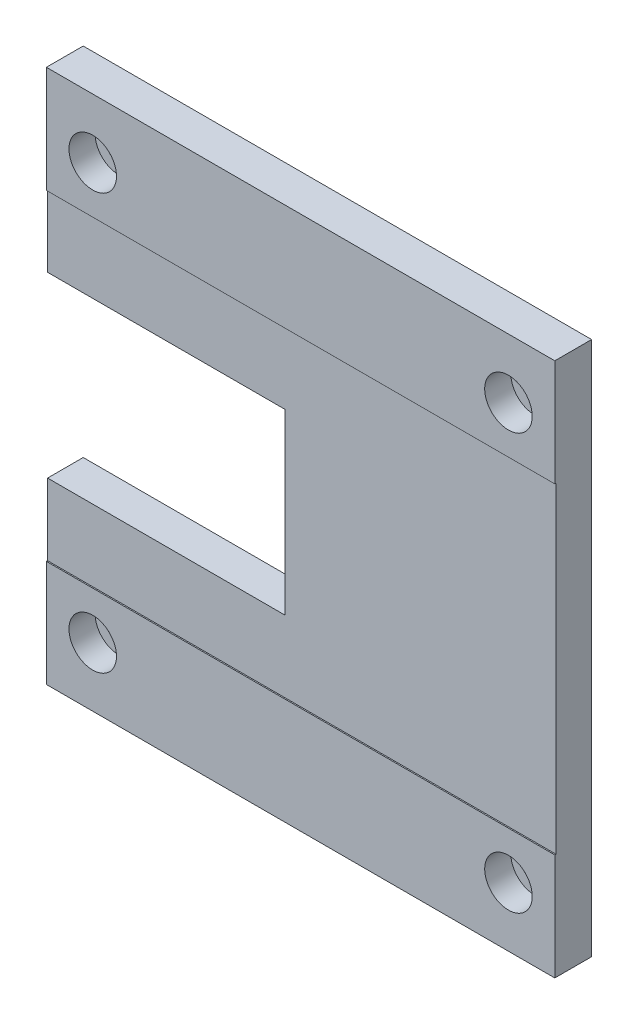
ISO-10303-21;
HEADER;
FILE_DESCRIPTION(('STEP AP214'),'2;1');
FILE_NAME('part.step','',(''),(''),'','','');
FILE_SCHEMA(('AUTOMOTIVE_DESIGN { 1 0 10303 214 1 1 1 1 }'));
ENDSEC;
DATA;
#1=APPLICATION_CONTEXT('core data for automotive mechanical design processes');
#2=APPLICATION_PROTOCOL_DEFINITION('international standard','automotive_design',2000,#1);
#3=PRODUCT_CONTEXT('',#1,'mechanical');
#4=PRODUCT('Part','Part','',(#3));
#5=PRODUCT_RELATED_PRODUCT_CATEGORY('part','',(#4));
#6=PRODUCT_DEFINITION_FORMATION('','',#4);
#7=PRODUCT_DEFINITION_CONTEXT('part definition',#1,'design');
#8=PRODUCT_DEFINITION('design','',#6,#7);
#9=PRODUCT_DEFINITION_SHAPE('','',#8);
#10=(LENGTH_UNIT() NAMED_UNIT(*) SI_UNIT(.MILLI.,.METRE.));
#11=(NAMED_UNIT(*) PLANE_ANGLE_UNIT() SI_UNIT($,.RADIAN.));
#12=(NAMED_UNIT(*) SI_UNIT($,.STERADIAN.) SOLID_ANGLE_UNIT());
#13=UNCERTAINTY_MEASURE_WITH_UNIT(LENGTH_MEASURE(1.E-05),#10,'distance_accuracy_value','');
#14=(GEOMETRIC_REPRESENTATION_CONTEXT(3) GLOBAL_UNCERTAINTY_ASSIGNED_CONTEXT((#13)) GLOBAL_UNIT_ASSIGNED_CONTEXT((#10,
#11,#12)) REPRESENTATION_CONTEXT('',''));
#15=CARTESIAN_POINT('',(0.,0.,0.));
#16=DIRECTION('',(0.,0.,1.));
#17=DIRECTION('',(1.,0.,0.));
#18=AXIS2_PLACEMENT_3D('',#15,#16,#17);
#19=CARTESIAN_POINT('',(0.,0.,6.));
#20=DIRECTION('',(1.,0.,0.));
#21=DIRECTION('',(0.,0.,-1.));
#22=AXIS2_PLACEMENT_3D('',#19,#20,#21);
#23=PLANE('',#22);
#24=DIRECTION('',(0.,-1.,0.));
#25=VECTOR('',#24,1.);
#26=CARTESIAN_POINT('',(0.,0.,0.));
#27=LINE('',#26,#25);
#28=CARTESIAN_POINT('',(0.,90.,0.));
#29=VERTEX_POINT('',#28);
#30=CARTESIAN_POINT('',(0.,60.,0.));
#31=VERTEX_POINT('',#30);
#32=EDGE_CURVE('E145',#29,#31,#27,.T.);
#33=ORIENTED_EDGE('',*,*,#32,.T.);
#34=DIRECTION('',(0.,0.,1.));
#35=VECTOR('',#34,1.);
#36=CARTESIAN_POINT('',(0.,60.,0.));
#37=LINE('',#36,#35);
#38=CARTESIAN_POINT('',(0.,60.,6.));
#39=VERTEX_POINT('',#38);
#40=EDGE_CURVE('E220',#31,#39,#37,.T.);
#41=ORIENTED_EDGE('',*,*,#40,.T.);
#42=DIRECTION('',(0.,-1.,0.));
#43=VECTOR('',#42,1.);
#44=CARTESIAN_POINT('',(0.,0.,6.));
#45=LINE('',#44,#43);
#46=CARTESIAN_POINT('',(0.,72.05,6.));
#47=VERTEX_POINT('',#46);
#48=EDGE_CURVE('E202',#47,#39,#45,.T.);
#49=ORIENTED_EDGE('',*,*,#48,.F.);
#50=DIRECTION('',(0.,0.,-1.));
#51=VECTOR('',#50,1.);
#52=CARTESIAN_POINT('',(0.,72.05,6.2));
#53=LINE('',#52,#51);
#54=CARTESIAN_POINT('',(0.,72.05,6.2));
#55=VERTEX_POINT('',#54);
#56=EDGE_CURVE('E146',#55,#47,#53,.T.);
#57=ORIENTED_EDGE('',*,*,#56,.F.);
#58=DIRECTION('',(0.,-1.,0.));
#59=VECTOR('',#58,1.);
#60=CARTESIAN_POINT('',(0.,90.,6.2));
#61=LINE('',#60,#59);
#62=CARTESIAN_POINT('',(0.,90.,6.2));
#63=VERTEX_POINT('',#62);
#64=EDGE_CURVE('E185',#63,#55,#61,.T.);
#65=ORIENTED_EDGE('',*,*,#64,.F.);
#66=DIRECTION('',(0.,0.,-1.));
#67=VECTOR('',#66,1.);
#68=CARTESIAN_POINT('',(0.,90.,6.));
#69=LINE('',#68,#67);
#70=EDGE_CURVE('E161',#63,#29,#69,.T.);
#71=ORIENTED_EDGE('',*,*,#70,.T.);
#72=EDGE_LOOP('',(#33,#41,#49,#57,#65,#71));
#73=FACE_BOUND('',#72,.T.);
#74=ADVANCED_FACE('F35',(#73),#23,.F.);
#75=CARTESIAN_POINT('',(0.,0.,6.));
#76=DIRECTION('',(0.,0.,-1.));
#77=DIRECTION('',(-1.,0.,0.));
#78=AXIS2_PLACEMENT_3D('',#75,#76,#77);
#79=PLANE('',#78);
#80=ORIENTED_EDGE('',*,*,#48,.T.);
#81=DIRECTION('',(-1.,0.,0.));
#82=VECTOR('',#81,1.);
#83=CARTESIAN_POINT('',(0.,60.,6.));
#84=LINE('',#83,#82);
#85=CARTESIAN_POINT('',(40.,60.,6.));
#86=VERTEX_POINT('',#85);
#87=EDGE_CURVE('E133',#86,#39,#84,.T.);
#88=ORIENTED_EDGE('',*,*,#87,.F.);
#89=DIRECTION('',(0.,1.,0.));
#90=VECTOR('',#89,1.);
#91=CARTESIAN_POINT('',(40.,60.,6.));
#92=LINE('',#91,#90);
#93=CARTESIAN_POINT('',(40.,30.,6.));
#94=VERTEX_POINT('',#93);
#95=EDGE_CURVE('E232',#94,#86,#92,.T.);
#96=ORIENTED_EDGE('',*,*,#95,.F.);
#97=DIRECTION('',(1.,0.,0.));
#98=VECTOR('',#97,1.);
#99=CARTESIAN_POINT('',(0.,30.,6.));
#100=LINE('',#99,#98);
#101=CARTESIAN_POINT('',(0.,30.,6.));
#102=VERTEX_POINT('',#101);
#103=EDGE_CURVE('E235',#102,#94,#100,.T.);
#104=ORIENTED_EDGE('',*,*,#103,.F.);
#105=CARTESIAN_POINT('',(0.,17.95,6.));
#106=VERTEX_POINT('',#105);
#107=EDGE_CURVE('E58',#102,#106,#45,.T.);
#108=ORIENTED_EDGE('',*,*,#107,.T.);
#109=DIRECTION('',(-1.,0.,0.));
#110=VECTOR('',#109,1.);
#111=CARTESIAN_POINT('',(85.6,17.95,6.));
#112=LINE('',#111,#110);
#113=CARTESIAN_POINT('',(85.6,17.95,6.));
#114=VERTEX_POINT('',#113);
#115=EDGE_CURVE('E206',#114,#106,#112,.T.);
#116=ORIENTED_EDGE('',*,*,#115,.F.);
#117=DIRECTION('',(0.,1.,0.));
#118=VECTOR('',#117,1.);
#119=CARTESIAN_POINT('',(85.6,0.,6.));
#120=LINE('',#119,#118);
#121=CARTESIAN_POINT('',(85.6,72.05,6.));
#122=VERTEX_POINT('',#121);
#123=EDGE_CURVE('E154',#114,#122,#120,.T.);
#124=ORIENTED_EDGE('',*,*,#123,.T.);
#125=DIRECTION('',(1.,0.,0.));
#126=VECTOR('',#125,1.);
#127=CARTESIAN_POINT('',(85.6,72.05,6.));
#128=LINE('',#127,#126);
#129=EDGE_CURVE('E197',#47,#122,#128,.T.);
#130=ORIENTED_EDGE('',*,*,#129,.F.);
#131=EDGE_LOOP('',(#80,#88,#96,#104,#108,#116,#124,#130));
#132=FACE_BOUND('',#131,.T.);
#133=ADVANCED_FACE('F205',(#132),#79,.F.);
#134=ORIENTED_EDGE('',*,*,#107,.F.);
#135=DIRECTION('',(0.,0.,1.));
#136=VECTOR('',#135,1.);
#137=CARTESIAN_POINT('',(0.,30.,0.));
#138=LINE('',#137,#136);
#139=CARTESIAN_POINT('',(0.,30.,0.));
#140=VERTEX_POINT('',#139);
#141=EDGE_CURVE('E129',#140,#102,#138,.T.);
#142=ORIENTED_EDGE('',*,*,#141,.F.);
#143=CARTESIAN_POINT('',(0.,0.,0.));
#144=VERTEX_POINT('',#143);
#145=EDGE_CURVE('E136',#140,#144,#27,.T.);
#146=ORIENTED_EDGE('',*,*,#145,.T.);
#147=DIRECTION('',(0.,0.,-1.));
#148=VECTOR('',#147,1.);
#149=CARTESIAN_POINT('',(0.,0.,6.));
#150=LINE('',#149,#148);
#151=CARTESIAN_POINT('',(0.,0.,6.2));
#152=VERTEX_POINT('',#151);
#153=EDGE_CURVE('E11',#152,#144,#150,.T.);
#154=ORIENTED_EDGE('',*,*,#153,.F.);
#155=DIRECTION('',(0.,-1.,0.));
#156=VECTOR('',#155,1.);
#157=CARTESIAN_POINT('',(0.,0.,6.2));
#158=LINE('',#157,#156);
#159=CARTESIAN_POINT('',(0.,17.95,6.2));
#160=VERTEX_POINT('',#159);
#161=EDGE_CURVE('E217',#160,#152,#158,.T.);
#162=ORIENTED_EDGE('',*,*,#161,.F.);
#163=DIRECTION('',(0.,0.,-1.));
#164=VECTOR('',#163,1.);
#165=CARTESIAN_POINT('',(0.,17.95,6.2));
#166=LINE('',#165,#164);
#167=EDGE_CURVE('E215',#160,#106,#166,.T.);
#168=ORIENTED_EDGE('',*,*,#167,.T.);
#169=EDGE_LOOP('',(#134,#142,#146,#154,#162,#168));
#170=FACE_BOUND('',#169,.T.);
#171=ADVANCED_FACE('F37',(#170),#23,.F.);
#172=CARTESIAN_POINT('',(0.,0.,6.));
#173=DIRECTION('',(0.,1.,0.));
#174=DIRECTION('',(0.,0.,1.));
#175=AXIS2_PLACEMENT_3D('',#172,#173,#174);
#176=PLANE('',#175);
#177=DIRECTION('',(1.,0.,0.));
#178=VECTOR('',#177,1.);
#179=CARTESIAN_POINT('',(0.,0.,0.));
#180=LINE('',#179,#178);
#181=CARTESIAN_POINT('',(85.6,0.,0.));
#182=VERTEX_POINT('',#181);
#183=EDGE_CURVE('E144',#144,#182,#180,.T.);
#184=ORIENTED_EDGE('',*,*,#183,.T.);
#185=DIRECTION('',(0.,0.,-1.));
#186=VECTOR('',#185,1.);
#187=CARTESIAN_POINT('',(85.6,0.,6.));
#188=LINE('',#187,#186);
#189=CARTESIAN_POINT('',(85.6,0.,6.2));
#190=VERTEX_POINT('',#189);
#191=EDGE_CURVE('E43',#190,#182,#188,.T.);
#192=ORIENTED_EDGE('',*,*,#191,.F.);
#193=DIRECTION('',(1.,0.,0.));
#194=VECTOR('',#193,1.);
#195=CARTESIAN_POINT('',(85.6,0.,6.2));
#196=LINE('',#195,#194);
#197=EDGE_CURVE('E219',#152,#190,#196,.T.);
#198=ORIENTED_EDGE('',*,*,#197,.F.);
#199=ORIENTED_EDGE('',*,*,#153,.T.);
#200=EDGE_LOOP('',(#184,#192,#198,#199));
#201=FACE_BOUND('',#200,.T.);
#202=ADVANCED_FACE('F320',(#201),#176,.F.);
#203=CARTESIAN_POINT('',(85.6,0.,6.));
#204=DIRECTION('',(-1.,0.,0.));
#205=DIRECTION('',(0.,0.,1.));
#206=AXIS2_PLACEMENT_3D('',#203,#204,#205);
#207=PLANE('',#206);
#208=DIRECTION('',(0.,1.,0.));
#209=VECTOR('',#208,1.);
#210=CARTESIAN_POINT('',(85.6,0.,0.));
#211=LINE('',#210,#209);
#212=CARTESIAN_POINT('',(85.6,90.,0.));
#213=VERTEX_POINT('',#212);
#214=EDGE_CURVE('E157',#182,#213,#211,.T.);
#215=ORIENTED_EDGE('',*,*,#214,.T.);
#216=DIRECTION('',(0.,0.,-1.));
#217=VECTOR('',#216,1.);
#218=CARTESIAN_POINT('',(85.6,90.,6.));
#219=LINE('',#218,#217);
#220=CARTESIAN_POINT('',(85.6,90.,6.2));
#221=VERTEX_POINT('',#220);
#222=EDGE_CURVE('E164',#221,#213,#219,.T.);
#223=ORIENTED_EDGE('',*,*,#222,.F.);
#224=DIRECTION('',(0.,1.,0.));
#225=VECTOR('',#224,1.);
#226=CARTESIAN_POINT('',(85.6,90.,6.2));
#227=LINE('',#226,#225);
#228=CARTESIAN_POINT('',(85.6,72.05,6.2));
#229=VERTEX_POINT('',#228);
#230=EDGE_CURVE('E193',#229,#221,#227,.T.);
#231=ORIENTED_EDGE('',*,*,#230,.F.);
#232=DIRECTION('',(0.,0.,-1.));
#233=VECTOR('',#232,1.);
#234=CARTESIAN_POINT('',(85.6,72.05,6.2));
#235=LINE('',#234,#233);
#236=EDGE_CURVE('E150',#229,#122,#235,.T.);
#237=ORIENTED_EDGE('',*,*,#236,.T.);
#238=ORIENTED_EDGE('',*,*,#123,.F.);
#239=DIRECTION('',(0.,0.,-1.));
#240=VECTOR('',#239,1.);
#241=CARTESIAN_POINT('',(85.6,17.95,6.2));
#242=LINE('',#241,#240);
#243=CARTESIAN_POINT('',(85.6,17.95,6.2));
#244=VERTEX_POINT('',#243);
#245=EDGE_CURVE('E200',#244,#114,#242,.T.);
#246=ORIENTED_EDGE('',*,*,#245,.F.);
#247=DIRECTION('',(0.,1.,0.));
#248=VECTOR('',#247,1.);
#249=CARTESIAN_POINT('',(85.6,0.,6.2));
#250=LINE('',#249,#248);
#251=EDGE_CURVE('E171',#190,#244,#250,.T.);
#252=ORIENTED_EDGE('',*,*,#251,.F.);
#253=ORIENTED_EDGE('',*,*,#191,.T.);
#254=EDGE_LOOP('',(#215,#223,#231,#237,#238,#246,#252,#253));
#255=FACE_BOUND('',#254,.T.);
#256=ADVANCED_FACE('F169',(#255),#207,.F.);
#257=CARTESIAN_POINT('',(0.,90.,6.));
#258=DIRECTION('',(0.,-1.,0.));
#259=DIRECTION('',(0.,0.,-1.));
#260=AXIS2_PLACEMENT_3D('',#257,#258,#259);
#261=PLANE('',#260);
#262=DIRECTION('',(-1.,0.,0.));
#263=VECTOR('',#262,1.);
#264=CARTESIAN_POINT('',(0.,90.,0.));
#265=LINE('',#264,#263);
#266=EDGE_CURVE('E159',#213,#29,#265,.T.);
#267=ORIENTED_EDGE('',*,*,#266,.T.);
#268=ORIENTED_EDGE('',*,*,#70,.F.);
#269=DIRECTION('',(-1.,0.,0.));
#270=VECTOR('',#269,1.);
#271=CARTESIAN_POINT('',(85.6,90.,6.2));
#272=LINE('',#271,#270);
#273=EDGE_CURVE('E190',#221,#63,#272,.T.);
#274=ORIENTED_EDGE('',*,*,#273,.F.);
#275=ORIENTED_EDGE('',*,*,#222,.T.);
#276=EDGE_LOOP('',(#267,#268,#274,#275));
#277=FACE_BOUND('',#276,.T.);
#278=ADVANCED_FACE('F178',(#277),#261,.F.);
#279=CARTESIAN_POINT('',(0.,0.,0.));
#280=DIRECTION('',(0.,0.,-1.));
#281=DIRECTION('',(-1.,0.,0.));
#282=AXIS2_PLACEMENT_3D('',#279,#280,#281);
#283=PLANE('',#282);
#284=CARTESIAN_POINT('',(77.8,80.,0.));
#285=DIRECTION('',(0.,0.,1.));
#286=DIRECTION('',(1.,0.,0.));
#287=AXIS2_PLACEMENT_3D('',#284,#285,#286);
#288=CIRCLE('',#287,2.25);
#289=CARTESIAN_POINT('',(80.05,80.,0.));
#290=VERTEX_POINT('',#289);
#291=EDGE_CURVE('E275',#290,#290,#288,.T.);
#292=ORIENTED_EDGE('',*,*,#291,.T.);
#293=EDGE_LOOP('',(#292));
#294=FACE_BOUND('',#293,.T.);
#295=CARTESIAN_POINT('',(7.8,80.,0.));
#296=DIRECTION('',(0.,0.,1.));
#297=DIRECTION('',(1.,0.,0.));
#298=AXIS2_PLACEMENT_3D('',#295,#296,#297);
#299=CIRCLE('',#298,2.25);
#300=CARTESIAN_POINT('',(10.05,80.,0.));
#301=VERTEX_POINT('',#300);
#302=EDGE_CURVE('E263',#301,#301,#299,.T.);
#303=ORIENTED_EDGE('',*,*,#302,.T.);
#304=EDGE_LOOP('',(#303));
#305=FACE_BOUND('',#304,.T.);
#306=CARTESIAN_POINT('',(7.80000000000001,9.99999999999999,0.));
#307=DIRECTION('',(0.,0.,1.));
#308=DIRECTION('',(1.,0.,0.));
#309=AXIS2_PLACEMENT_3D('',#306,#307,#308);
#310=CIRCLE('',#309,2.25);
#311=CARTESIAN_POINT('',(10.05,9.99999999999999,0.));
#312=VERTEX_POINT('',#311);
#313=EDGE_CURVE('E251',#312,#312,#310,.T.);
#314=ORIENTED_EDGE('',*,*,#313,.T.);
#315=EDGE_LOOP('',(#314));
#316=FACE_BOUND('',#315,.T.);
#317=CARTESIAN_POINT('',(77.8,10.,0.));
#318=DIRECTION('',(0.,0.,1.));
#319=DIRECTION('',(1.,0.,0.));
#320=AXIS2_PLACEMENT_3D('',#317,#318,#319);
#321=CIRCLE('',#320,2.25);
#322=CARTESIAN_POINT('',(80.05,10.,0.));
#323=VERTEX_POINT('',#322);
#324=EDGE_CURVE('E237',#323,#323,#321,.T.);
#325=ORIENTED_EDGE('',*,*,#324,.T.);
#326=EDGE_LOOP('',(#325));
#327=FACE_BOUND('',#326,.T.);
#328=DIRECTION('',(-1.,0.,0.));
#329=VECTOR('',#328,1.);
#330=CARTESIAN_POINT('',(0.,60.,0.));
#331=LINE('',#330,#329);
#332=CARTESIAN_POINT('',(40.,60.,0.));
#333=VERTEX_POINT('',#332);
#334=EDGE_CURVE('E139',#333,#31,#331,.T.);
#335=ORIENTED_EDGE('',*,*,#334,.T.);
#336=ORIENTED_EDGE('',*,*,#32,.F.);
#337=ORIENTED_EDGE('',*,*,#266,.F.);
#338=ORIENTED_EDGE('',*,*,#214,.F.);
#339=ORIENTED_EDGE('',*,*,#183,.F.);
#340=ORIENTED_EDGE('',*,*,#145,.F.);
#341=DIRECTION('',(1.,0.,0.));
#342=VECTOR('',#341,1.);
#343=CARTESIAN_POINT('',(0.,30.,0.));
#344=LINE('',#343,#342);
#345=CARTESIAN_POINT('',(40.,30.,0.));
#346=VERTEX_POINT('',#345);
#347=EDGE_CURVE('E125',#140,#346,#344,.T.);
#348=ORIENTED_EDGE('',*,*,#347,.T.);
#349=DIRECTION('',(0.,1.,0.));
#350=VECTOR('',#349,1.);
#351=CARTESIAN_POINT('',(40.,60.,0.));
#352=LINE('',#351,#350);
#353=EDGE_CURVE('E50',#346,#333,#352,.T.);
#354=ORIENTED_EDGE('',*,*,#353,.T.);
#355=EDGE_LOOP('',(#335,#336,#337,#338,#339,#340,#348,#354));
#356=FACE_BOUND('',#355,.T.);
#357=ADVANCED_FACE('F142',(#294,#305,#316,#327,#356),#283,.T.);
#358=CARTESIAN_POINT('',(85.6,72.05,6.2));
#359=DIRECTION('',(0.,1.,0.));
#360=DIRECTION('',(0.,0.,1.));
#361=AXIS2_PLACEMENT_3D('',#358,#359,#360);
#362=PLANE('',#361);
#363=ORIENTED_EDGE('',*,*,#129,.T.);
#364=ORIENTED_EDGE('',*,*,#236,.F.);
#365=DIRECTION('',(1.,0.,0.));
#366=VECTOR('',#365,1.);
#367=CARTESIAN_POINT('',(85.6,72.05,6.2));
#368=LINE('',#367,#366);
#369=EDGE_CURVE('E189',#55,#229,#368,.T.);
#370=ORIENTED_EDGE('',*,*,#369,.F.);
#371=ORIENTED_EDGE('',*,*,#56,.T.);
#372=EDGE_LOOP('',(#363,#364,#370,#371));
#373=FACE_BOUND('',#372,.T.);
#374=ADVANCED_FACE('F210',(#373),#362,.F.);
#375=CARTESIAN_POINT('',(0.,0.,6.2));
#376=DIRECTION('',(0.,0.,-1.));
#377=DIRECTION('',(-1.,0.,0.));
#378=AXIS2_PLACEMENT_3D('',#375,#376,#377);
#379=PLANE('',#378);
#380=CARTESIAN_POINT('',(77.8,80.,6.2));
#381=DIRECTION('',(0.,0.,1.));
#382=DIRECTION('',(1.,0.,0.));
#383=AXIS2_PLACEMENT_3D('',#380,#381,#382);
#384=CIRCLE('',#383,4.);
#385=CARTESIAN_POINT('',(81.8,80.,6.2));
#386=VERTEX_POINT('',#385);
#387=EDGE_CURVE('E284',#386,#386,#384,.T.);
#388=ORIENTED_EDGE('',*,*,#387,.F.);
#389=EDGE_LOOP('',(#388));
#390=FACE_BOUND('',#389,.T.);
#391=CARTESIAN_POINT('',(7.8,80.,6.2));
#392=DIRECTION('',(0.,0.,1.));
#393=DIRECTION('',(1.,0.,0.));
#394=AXIS2_PLACEMENT_3D('',#391,#392,#393);
#395=CIRCLE('',#394,4.);
#396=CARTESIAN_POINT('',(11.8,80.,6.2));
#397=VERTEX_POINT('',#396);
#398=EDGE_CURVE('E272',#397,#397,#395,.T.);
#399=ORIENTED_EDGE('',*,*,#398,.F.);
#400=EDGE_LOOP('',(#399));
#401=FACE_BOUND('',#400,.T.);
#402=ORIENTED_EDGE('',*,*,#230,.T.);
#403=ORIENTED_EDGE('',*,*,#273,.T.);
#404=ORIENTED_EDGE('',*,*,#64,.T.);
#405=ORIENTED_EDGE('',*,*,#369,.T.);
#406=EDGE_LOOP('',(#402,#403,#404,#405));
#407=FACE_BOUND('',#406,.T.);
#408=ADVANCED_FACE('F290',(#390,#401,#407),#379,.F.);
#409=CARTESIAN_POINT('',(85.6,17.95,6.2));
#410=DIRECTION('',(0.,-1.,0.));
#411=DIRECTION('',(0.,0.,-1.));
#412=AXIS2_PLACEMENT_3D('',#409,#410,#411);
#413=PLANE('',#412);
#414=ORIENTED_EDGE('',*,*,#115,.T.);
#415=ORIENTED_EDGE('',*,*,#167,.F.);
#416=DIRECTION('',(-1.,0.,0.));
#417=VECTOR('',#416,1.);
#418=CARTESIAN_POINT('',(85.6,17.95,6.2));
#419=LINE('',#418,#417);
#420=EDGE_CURVE('E223',#244,#160,#419,.T.);
#421=ORIENTED_EDGE('',*,*,#420,.F.);
#422=ORIENTED_EDGE('',*,*,#245,.T.);
#423=EDGE_LOOP('',(#414,#415,#421,#422));
#424=FACE_BOUND('',#423,.T.);
#425=ADVANCED_FACE('F293',(#424),#413,.F.);
#426=CARTESIAN_POINT('',(0.,0.,6.2));
#427=DIRECTION('',(0.,0.,-1.));
#428=DIRECTION('',(-1.,0.,0.));
#429=AXIS2_PLACEMENT_3D('',#426,#427,#428);
#430=PLANE('',#429);
#431=CARTESIAN_POINT('',(7.80000000000001,9.99999999999999,6.2));
#432=DIRECTION('',(0.,0.,1.));
#433=DIRECTION('',(1.,0.,0.));
#434=AXIS2_PLACEMENT_3D('',#431,#432,#433);
#435=CIRCLE('',#434,4.);
#436=CARTESIAN_POINT('',(11.8,9.99999999999999,6.2));
#437=VERTEX_POINT('',#436);
#438=EDGE_CURVE('E260',#437,#437,#435,.T.);
#439=ORIENTED_EDGE('',*,*,#438,.F.);
#440=EDGE_LOOP('',(#439));
#441=FACE_BOUND('',#440,.T.);
#442=CARTESIAN_POINT('',(77.8,10.,6.2));
#443=DIRECTION('',(0.,0.,1.));
#444=DIRECTION('',(1.,0.,0.));
#445=AXIS2_PLACEMENT_3D('',#442,#443,#444);
#446=CIRCLE('',#445,4.);
#447=CARTESIAN_POINT('',(81.8,10.,6.2));
#448=VERTEX_POINT('',#447);
#449=EDGE_CURVE('E248',#448,#448,#446,.T.);
#450=ORIENTED_EDGE('',*,*,#449,.F.);
#451=EDGE_LOOP('',(#450));
#452=FACE_BOUND('',#451,.T.);
#453=ORIENTED_EDGE('',*,*,#197,.T.);
#454=ORIENTED_EDGE('',*,*,#251,.T.);
#455=ORIENTED_EDGE('',*,*,#420,.T.);
#456=ORIENTED_EDGE('',*,*,#161,.T.);
#457=EDGE_LOOP('',(#453,#454,#455,#456));
#458=FACE_BOUND('',#457,.T.);
#459=ADVANCED_FACE('F338',(#441,#452,#458),#430,.F.);
#460=CARTESIAN_POINT('',(0.,60.,0.));
#461=DIRECTION('',(0.,1.,0.));
#462=DIRECTION('',(0.,0.,1.));
#463=AXIS2_PLACEMENT_3D('',#460,#461,#462);
#464=PLANE('',#463);
#465=ORIENTED_EDGE('',*,*,#87,.T.);
#466=ORIENTED_EDGE('',*,*,#40,.F.);
#467=ORIENTED_EDGE('',*,*,#334,.F.);
#468=DIRECTION('',(0.,0.,1.));
#469=VECTOR('',#468,1.);
#470=CARTESIAN_POINT('',(40.,60.,0.));
#471=LINE('',#470,#469);
#472=EDGE_CURVE('E228',#333,#86,#471,.T.);
#473=ORIENTED_EDGE('',*,*,#472,.T.);
#474=EDGE_LOOP('',(#465,#466,#467,#473));
#475=FACE_BOUND('',#474,.T.);
#476=ADVANCED_FACE('F342',(#475),#464,.F.);
#477=CARTESIAN_POINT('',(40.,60.,0.));
#478=DIRECTION('',(1.,0.,0.));
#479=DIRECTION('',(0.,0.,-1.));
#480=AXIS2_PLACEMENT_3D('',#477,#478,#479);
#481=PLANE('',#480);
#482=ORIENTED_EDGE('',*,*,#95,.T.);
#483=ORIENTED_EDGE('',*,*,#472,.F.);
#484=ORIENTED_EDGE('',*,*,#353,.F.);
#485=DIRECTION('',(0.,0.,1.));
#486=VECTOR('',#485,1.);
#487=CARTESIAN_POINT('',(40.,30.,0.));
#488=LINE('',#487,#486);
#489=EDGE_CURVE('E130',#346,#94,#488,.T.);
#490=ORIENTED_EDGE('',*,*,#489,.T.);
#491=EDGE_LOOP('',(#482,#483,#484,#490));
#492=FACE_BOUND('',#491,.T.);
#493=ADVANCED_FACE('F347',(#492),#481,.F.);
#494=CARTESIAN_POINT('',(0.,30.,0.));
#495=DIRECTION('',(0.,-1.,0.));
#496=DIRECTION('',(0.,0.,-1.));
#497=AXIS2_PLACEMENT_3D('',#494,#495,#496);
#498=PLANE('',#497);
#499=ORIENTED_EDGE('',*,*,#103,.T.);
#500=ORIENTED_EDGE('',*,*,#489,.F.);
#501=ORIENTED_EDGE('',*,*,#347,.F.);
#502=ORIENTED_EDGE('',*,*,#141,.T.);
#503=EDGE_LOOP('',(#499,#500,#501,#502));
#504=FACE_BOUND('',#503,.T.);
#505=ADVANCED_FACE('F128',(#504),#498,.F.);
#506=CARTESIAN_POINT('',(77.8,10.,6.2));
#507=DIRECTION('',(0.,0.,1.));
#508=DIRECTION('',(1.,0.,0.));
#509=AXIS2_PLACEMENT_3D('',#506,#507,#508);
#510=CYLINDRICAL_SURFACE('',#509,2.25);
#511=ORIENTED_EDGE('',*,*,#324,.F.);
#512=EDGE_LOOP('',(#511));
#513=FACE_BOUND('',#512,.T.);
#514=CARTESIAN_POINT('',(77.8,10.,1.8));
#515=DIRECTION('',(0.,0.,1.));
#516=DIRECTION('',(1.,0.,0.));
#517=AXIS2_PLACEMENT_3D('',#514,#515,#516);
#518=CIRCLE('',#517,2.25);
#519=CARTESIAN_POINT('',(80.05,10.,1.8));
#520=VERTEX_POINT('',#519);
#521=EDGE_CURVE('E242',#520,#520,#518,.T.);
#522=ORIENTED_EDGE('',*,*,#521,.T.);
#523=EDGE_LOOP('',(#522));
#524=FACE_BOUND('',#523,.T.);
#525=ADVANCED_FACE('F346',(#513,#524),#510,.F.);
#526=CARTESIAN_POINT('',(80.05,10.,1.8));
#527=DIRECTION('',(0.,0.,-1.));
#528=DIRECTION('',(-1.,0.,0.));
#529=AXIS2_PLACEMENT_3D('',#526,#527,#528);
#530=PLANE('',#529);
#531=ORIENTED_EDGE('',*,*,#521,.F.);
#532=EDGE_LOOP('',(#531));
#533=FACE_BOUND('',#532,.T.);
#534=CARTESIAN_POINT('',(77.8,10.,1.8));
#535=DIRECTION('',(0.,0.,1.));
#536=DIRECTION('',(1.,0.,0.));
#537=AXIS2_PLACEMENT_3D('',#534,#535,#536);
#538=CIRCLE('',#537,4.);
#539=CARTESIAN_POINT('',(81.8,10.,1.8));
#540=VERTEX_POINT('',#539);
#541=EDGE_CURVE('E245',#540,#540,#538,.T.);
#542=ORIENTED_EDGE('',*,*,#541,.T.);
#543=EDGE_LOOP('',(#542));
#544=FACE_BOUND('',#543,.T.);
#545=ADVANCED_FACE('F355',(#533,#544),#530,.F.);
#546=CARTESIAN_POINT('',(77.8,10.,6.2));
#547=DIRECTION('',(0.,0.,1.));
#548=DIRECTION('',(1.,0.,0.));
#549=AXIS2_PLACEMENT_3D('',#546,#547,#548);
#550=CYLINDRICAL_SURFACE('',#549,4.);
#551=ORIENTED_EDGE('',*,*,#541,.F.);
#552=EDGE_LOOP('',(#551));
#553=FACE_BOUND('',#552,.T.);
#554=ORIENTED_EDGE('',*,*,#449,.T.);
#555=EDGE_LOOP('',(#554));
#556=FACE_BOUND('',#555,.T.);
#557=ADVANCED_FACE('F359',(#553,#556),#550,.F.);
#558=CARTESIAN_POINT('',(7.80000000000001,9.99999999999999,6.2));
#559=DIRECTION('',(0.,0.,1.));
#560=DIRECTION('',(1.,0.,0.));
#561=AXIS2_PLACEMENT_3D('',#558,#559,#560);
#562=CYLINDRICAL_SURFACE('',#561,2.25);
#563=ORIENTED_EDGE('',*,*,#313,.F.);
#564=EDGE_LOOP('',(#563));
#565=FACE_BOUND('',#564,.T.);
#566=CARTESIAN_POINT('',(7.80000000000001,9.99999999999999,1.8));
#567=DIRECTION('',(0.,0.,1.));
#568=DIRECTION('',(1.,0.,0.));
#569=AXIS2_PLACEMENT_3D('',#566,#567,#568);
#570=CIRCLE('',#569,2.25);
#571=CARTESIAN_POINT('',(10.05,9.99999999999999,1.8));
#572=VERTEX_POINT('',#571);
#573=EDGE_CURVE('E254',#572,#572,#570,.T.);
#574=ORIENTED_EDGE('',*,*,#573,.T.);
#575=EDGE_LOOP('',(#574));
#576=FACE_BOUND('',#575,.T.);
#577=ADVANCED_FACE('F363',(#565,#576),#562,.F.);
#578=CARTESIAN_POINT('',(10.05,9.99999999999999,1.8));
#579=DIRECTION('',(0.,0.,-1.));
#580=DIRECTION('',(-1.,0.,0.));
#581=AXIS2_PLACEMENT_3D('',#578,#579,#580);
#582=PLANE('',#581);
#583=ORIENTED_EDGE('',*,*,#573,.F.);
#584=EDGE_LOOP('',(#583));
#585=FACE_BOUND('',#584,.T.);
#586=CARTESIAN_POINT('',(7.80000000000001,9.99999999999999,1.8));
#587=DIRECTION('',(0.,0.,1.));
#588=DIRECTION('',(1.,0.,0.));
#589=AXIS2_PLACEMENT_3D('',#586,#587,#588);
#590=CIRCLE('',#589,4.);
#591=CARTESIAN_POINT('',(11.8,9.99999999999999,1.8));
#592=VERTEX_POINT('',#591);
#593=EDGE_CURVE('E257',#592,#592,#590,.T.);
#594=ORIENTED_EDGE('',*,*,#593,.T.);
#595=EDGE_LOOP('',(#594));
#596=FACE_BOUND('',#595,.T.);
#597=ADVANCED_FACE('F367',(#585,#596),#582,.F.);
#598=CARTESIAN_POINT('',(7.80000000000001,9.99999999999999,6.2));
#599=DIRECTION('',(0.,0.,1.));
#600=DIRECTION('',(1.,0.,0.));
#601=AXIS2_PLACEMENT_3D('',#598,#599,#600);
#602=CYLINDRICAL_SURFACE('',#601,4.);
#603=ORIENTED_EDGE('',*,*,#593,.F.);
#604=EDGE_LOOP('',(#603));
#605=FACE_BOUND('',#604,.T.);
#606=ORIENTED_EDGE('',*,*,#438,.T.);
#607=EDGE_LOOP('',(#606));
#608=FACE_BOUND('',#607,.T.);
#609=ADVANCED_FACE('F371',(#605,#608),#602,.F.);
#610=CARTESIAN_POINT('',(7.8,80.,6.2));
#611=DIRECTION('',(0.,0.,1.));
#612=DIRECTION('',(1.,0.,0.));
#613=AXIS2_PLACEMENT_3D('',#610,#611,#612);
#614=CYLINDRICAL_SURFACE('',#613,2.25);
#615=ORIENTED_EDGE('',*,*,#302,.F.);
#616=EDGE_LOOP('',(#615));
#617=FACE_BOUND('',#616,.T.);
#618=CARTESIAN_POINT('',(7.8,80.,1.8));
#619=DIRECTION('',(0.,0.,1.));
#620=DIRECTION('',(1.,0.,0.));
#621=AXIS2_PLACEMENT_3D('',#618,#619,#620);
#622=CIRCLE('',#621,2.25);
#623=CARTESIAN_POINT('',(10.05,80.,1.8));
#624=VERTEX_POINT('',#623);
#625=EDGE_CURVE('E266',#624,#624,#622,.T.);
#626=ORIENTED_EDGE('',*,*,#625,.T.);
#627=EDGE_LOOP('',(#626));
#628=FACE_BOUND('',#627,.T.);
#629=ADVANCED_FACE('F310',(#617,#628),#614,.F.);
#630=CARTESIAN_POINT('',(10.05,80.,1.8));
#631=DIRECTION('',(0.,0.,-1.));
#632=DIRECTION('',(-1.,0.,0.));
#633=AXIS2_PLACEMENT_3D('',#630,#631,#632);
#634=PLANE('',#633);
#635=ORIENTED_EDGE('',*,*,#625,.F.);
#636=EDGE_LOOP('',(#635));
#637=FACE_BOUND('',#636,.T.);
#638=CARTESIAN_POINT('',(7.8,80.,1.8));
#639=DIRECTION('',(0.,0.,1.));
#640=DIRECTION('',(1.,0.,0.));
#641=AXIS2_PLACEMENT_3D('',#638,#639,#640);
#642=CIRCLE('',#641,4.);
#643=CARTESIAN_POINT('',(11.8,80.,1.8));
#644=VERTEX_POINT('',#643);
#645=EDGE_CURVE('E269',#644,#644,#642,.T.);
#646=ORIENTED_EDGE('',*,*,#645,.T.);
#647=EDGE_LOOP('',(#646));
#648=FACE_BOUND('',#647,.T.);
#649=ADVANCED_FACE('F300',(#637,#648),#634,.F.);
#650=CARTESIAN_POINT('',(7.8,80.,6.2));
#651=DIRECTION('',(0.,0.,1.));
#652=DIRECTION('',(1.,0.,0.));
#653=AXIS2_PLACEMENT_3D('',#650,#651,#652);
#654=CYLINDRICAL_SURFACE('',#653,4.);
#655=ORIENTED_EDGE('',*,*,#645,.F.);
#656=EDGE_LOOP('',(#655));
#657=FACE_BOUND('',#656,.T.);
#658=ORIENTED_EDGE('',*,*,#398,.T.);
#659=EDGE_LOOP('',(#658));
#660=FACE_BOUND('',#659,.T.);
#661=ADVANCED_FACE('F297',(#657,#660),#654,.F.);
#662=CARTESIAN_POINT('',(77.8,80.,6.2));
#663=DIRECTION('',(0.,0.,1.));
#664=DIRECTION('',(1.,0.,0.));
#665=AXIS2_PLACEMENT_3D('',#662,#663,#664);
#666=CYLINDRICAL_SURFACE('',#665,2.25);
#667=ORIENTED_EDGE('',*,*,#291,.F.);
#668=EDGE_LOOP('',(#667));
#669=FACE_BOUND('',#668,.T.);
#670=CARTESIAN_POINT('',(77.8,80.,1.8));
#671=DIRECTION('',(0.,0.,1.));
#672=DIRECTION('',(1.,0.,0.));
#673=AXIS2_PLACEMENT_3D('',#670,#671,#672);
#674=CIRCLE('',#673,2.25);
#675=CARTESIAN_POINT('',(80.05,80.,1.8));
#676=VERTEX_POINT('',#675);
#677=EDGE_CURVE('E278',#676,#676,#674,.T.);
#678=ORIENTED_EDGE('',*,*,#677,.T.);
#679=EDGE_LOOP('',(#678));
#680=FACE_BOUND('',#679,.T.);
#681=ADVANCED_FACE('F299',(#669,#680),#666,.F.);
#682=CARTESIAN_POINT('',(80.05,80.,1.8));
#683=DIRECTION('',(0.,0.,-1.));
#684=DIRECTION('',(-1.,0.,0.));
#685=AXIS2_PLACEMENT_3D('',#682,#683,#684);
#686=PLANE('',#685);
#687=ORIENTED_EDGE('',*,*,#677,.F.);
#688=EDGE_LOOP('',(#687));
#689=FACE_BOUND('',#688,.T.);
#690=CARTESIAN_POINT('',(77.8,80.,1.8));
#691=DIRECTION('',(0.,0.,1.));
#692=DIRECTION('',(1.,0.,0.));
#693=AXIS2_PLACEMENT_3D('',#690,#691,#692);
#694=CIRCLE('',#693,4.);
#695=CARTESIAN_POINT('',(81.8,80.,1.8));
#696=VERTEX_POINT('',#695);
#697=EDGE_CURVE('E281',#696,#696,#694,.T.);
#698=ORIENTED_EDGE('',*,*,#697,.T.);
#699=EDGE_LOOP('',(#698));
#700=FACE_BOUND('',#699,.T.);
#701=ADVANCED_FACE('F307',(#689,#700),#686,.F.);
#702=CARTESIAN_POINT('',(77.8,80.,6.2));
#703=DIRECTION('',(0.,0.,1.));
#704=DIRECTION('',(1.,0.,0.));
#705=AXIS2_PLACEMENT_3D('',#702,#703,#704);
#706=CYLINDRICAL_SURFACE('',#705,4.);
#707=ORIENTED_EDGE('',*,*,#697,.F.);
#708=EDGE_LOOP('',(#707));
#709=FACE_BOUND('',#708,.T.);
#710=ORIENTED_EDGE('',*,*,#387,.T.);
#711=EDGE_LOOP('',(#710));
#712=FACE_BOUND('',#711,.T.);
#713=ADVANCED_FACE('F288',(#709,#712),#706,.F.);
#714=CLOSED_SHELL('',(#74,#133,#171,#202,#256,#278,#357,#374,#408,#425,#459,#476,#493,#505,#525,
#545,#557,#577,#597,#609,#629,#649,#661,#681,#701,#713));
#715=MANIFOLD_SOLID_BREP('B2',#714);
#716=ADVANCED_BREP_SHAPE_REPRESENTATION('',(#18,#715),#14);
#717=SHAPE_DEFINITION_REPRESENTATION(#9,#716);
ENDSEC;
END-ISO-10303-21;
